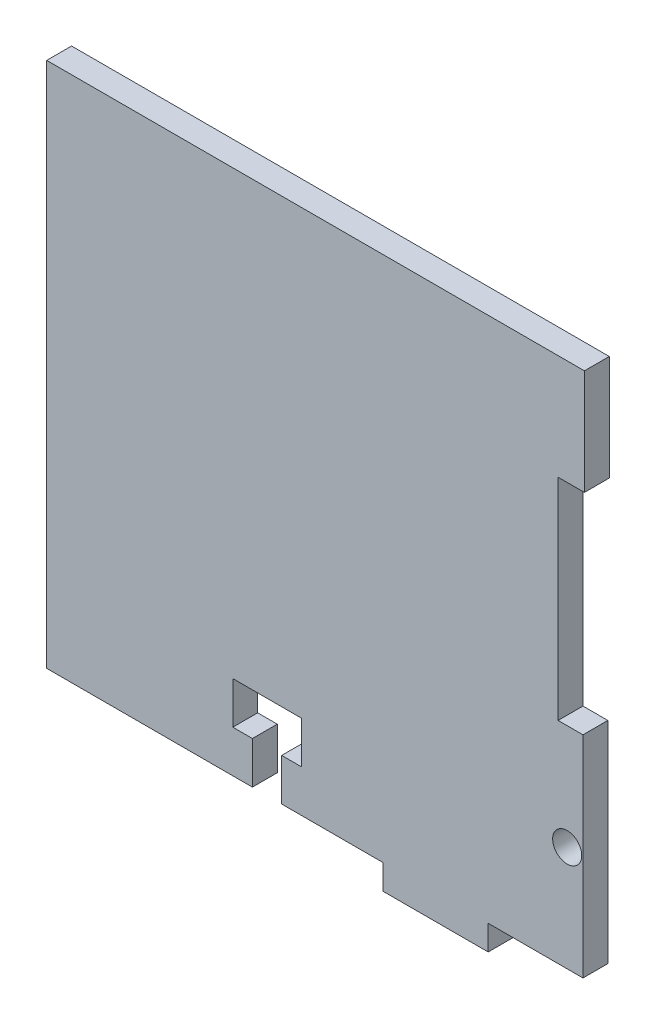
ISO-10303-21;
HEADER;
FILE_DESCRIPTION(('STEP AP214'),'2;1');
FILE_NAME('part.step','',(''),(''),'','','');
FILE_SCHEMA(('AUTOMOTIVE_DESIGN { 1 0 10303 214 1 1 1 1 }'));
ENDSEC;
DATA;
#1=APPLICATION_CONTEXT('core data for automotive mechanical design processes');
#2=APPLICATION_PROTOCOL_DEFINITION('international standard','automotive_design',2000,#1);
#3=PRODUCT_CONTEXT('',#1,'mechanical');
#4=PRODUCT('Part','Part','',(#3));
#5=PRODUCT_RELATED_PRODUCT_CATEGORY('part','',(#4));
#6=PRODUCT_DEFINITION_FORMATION('','',#4);
#7=PRODUCT_DEFINITION_CONTEXT('part definition',#1,'design');
#8=PRODUCT_DEFINITION('design','',#6,#7);
#9=PRODUCT_DEFINITION_SHAPE('','',#8);
#10=(LENGTH_UNIT() NAMED_UNIT(*) SI_UNIT(.MILLI.,.METRE.));
#11=(NAMED_UNIT(*) PLANE_ANGLE_UNIT() SI_UNIT($,.RADIAN.));
#12=(NAMED_UNIT(*) SI_UNIT($,.STERADIAN.) SOLID_ANGLE_UNIT());
#13=UNCERTAINTY_MEASURE_WITH_UNIT(LENGTH_MEASURE(1.E-05),#10,'distance_accuracy_value','');
#14=(GEOMETRIC_REPRESENTATION_CONTEXT(3) GLOBAL_UNCERTAINTY_ASSIGNED_CONTEXT((#13)) GLOBAL_UNIT_ASSIGNED_CONTEXT((#10,
#11,#12)) REPRESENTATION_CONTEXT('',''));
#15=CARTESIAN_POINT('',(0.,0.,0.));
#16=DIRECTION('',(0.,0.,1.));
#17=DIRECTION('',(1.,0.,0.));
#18=AXIS2_PLACEMENT_3D('',#15,#16,#17);
#19=CARTESIAN_POINT('',(0.,0.,3.));
#20=DIRECTION('',(0.,0.,1.));
#21=DIRECTION('',(1.,0.,0.));
#22=AXIS2_PLACEMENT_3D('',#19,#20,#21);
#23=PLANE('',#22);
#24=DIRECTION('',(1.,0.,0.));
#25=VECTOR('',#24,1.);
#26=CARTESIAN_POINT('',(102.87,-31.75,3.));
#27=LINE('',#26,#25);
#28=CARTESIAN_POINT('',(102.87,-31.75,3.));
#29=VERTEX_POINT('',#28);
#30=CARTESIAN_POINT('',(114.3,-31.75,3.));
#31=VERTEX_POINT('',#30);
#32=EDGE_CURVE('E128',#29,#31,#27,.T.);
#33=ORIENTED_EDGE('',*,*,#32,.T.);
#34=DIRECTION('',(0.,1.,0.));
#35=VECTOR('',#34,1.);
#36=CARTESIAN_POINT('',(114.3,-31.75,3.));
#37=LINE('',#36,#35);
#38=CARTESIAN_POINT('',(114.3,-6.35000000000001,3.));
#39=VERTEX_POINT('',#38);
#40=EDGE_CURVE('E350',#31,#39,#37,.T.);
#41=ORIENTED_EDGE('',*,*,#40,.T.);
#42=DIRECTION('',(-1.,0.,0.));
#43=VECTOR('',#42,1.);
#44=CARTESIAN_POINT('',(114.3,-6.35000000000001,3.));
#45=LINE('',#44,#43);
#46=CARTESIAN_POINT('',(111.3,-6.35000000000001,3.));
#47=VERTEX_POINT('',#46);
#48=EDGE_CURVE('E294',#39,#47,#45,.T.);
#49=ORIENTED_EDGE('',*,*,#48,.T.);
#50=DIRECTION('',(0.,1.,0.));
#51=VECTOR('',#50,1.);
#52=CARTESIAN_POINT('',(111.3,19.05,3.));
#53=LINE('',#52,#51);
#54=CARTESIAN_POINT('',(111.3,19.05,3.));
#55=VERTEX_POINT('',#54);
#56=EDGE_CURVE('E313',#47,#55,#53,.T.);
#57=ORIENTED_EDGE('',*,*,#56,.T.);
#58=DIRECTION('',(1.,0.,0.));
#59=VECTOR('',#58,1.);
#60=CARTESIAN_POINT('',(114.475,19.05,3.));
#61=LINE('',#60,#59);
#62=CARTESIAN_POINT('',(114.475,19.05,3.));
#63=VERTEX_POINT('',#62);
#64=EDGE_CURVE('E310',#55,#63,#61,.T.);
#65=ORIENTED_EDGE('',*,*,#64,.T.);
#66=DIRECTION('',(0.,1.,0.));
#67=VECTOR('',#66,1.);
#68=CARTESIAN_POINT('',(114.475,31.75,3.));
#69=LINE('',#68,#67);
#70=CARTESIAN_POINT('',(114.475,31.75,3.));
#71=VERTEX_POINT('',#70);
#72=EDGE_CURVE('E312',#63,#71,#69,.T.);
#73=ORIENTED_EDGE('',*,*,#72,.T.);
#74=DIRECTION('',(-1.,0.,0.));
#75=VECTOR('',#74,1.);
#76=CARTESIAN_POINT('',(111.125,31.75,3.));
#77=LINE('',#76,#75);
#78=CARTESIAN_POINT('',(49.6283285889026,31.75,3.));
#79=VERTEX_POINT('',#78);
#80=EDGE_CURVE('E315',#71,#79,#77,.T.);
#81=ORIENTED_EDGE('',*,*,#80,.T.);
#82=DIRECTION('',(0.,-1.,0.));
#83=VECTOR('',#82,1.);
#84=CARTESIAN_POINT('',(49.6283285889026,31.75,3.));
#85=LINE('',#84,#83);
#86=CARTESIAN_POINT('',(49.6283285889026,-31.75,3.));
#87=VERTEX_POINT('',#86);
#88=EDGE_CURVE('E321',#79,#87,#85,.T.);
#89=ORIENTED_EDGE('',*,*,#88,.T.);
#90=DIRECTION('',(1.,0.,0.));
#91=VECTOR('',#90,1.);
#92=CARTESIAN_POINT('',(49.6283285889026,-31.75,3.));
#93=LINE('',#92,#91);
#94=CARTESIAN_POINT('',(74.4347,-31.75,3.));
#95=VERTEX_POINT('',#94);
#96=EDGE_CURVE('E323',#87,#95,#93,.T.);
#97=ORIENTED_EDGE('',*,*,#96,.T.);
#98=DIRECTION('',(0.,1.,0.));
#99=VECTOR('',#98,1.);
#100=CARTESIAN_POINT('',(74.4347,-31.75,3.));
#101=LINE('',#100,#99);
#102=CARTESIAN_POINT('',(74.4347,-26.67,3.));
#103=VERTEX_POINT('',#102);
#104=EDGE_CURVE('E325',#95,#103,#101,.T.);
#105=ORIENTED_EDGE('',*,*,#104,.T.);
#106=DIRECTION('',(-1.,0.,0.));
#107=VECTOR('',#106,1.);
#108=CARTESIAN_POINT('',(72.0725,-26.67,3.));
#109=LINE('',#108,#107);
#110=CARTESIAN_POINT('',(72.0725,-26.67,3.));
#111=VERTEX_POINT('',#110);
#112=EDGE_CURVE('E327',#103,#111,#109,.T.);
#113=ORIENTED_EDGE('',*,*,#112,.T.);
#114=DIRECTION('',(0.,1.,0.));
#115=VECTOR('',#114,1.);
#116=CARTESIAN_POINT('',(72.0725,-26.67,3.));
#117=LINE('',#116,#115);
#118=CARTESIAN_POINT('',(72.0725,-21.59,3.));
#119=VERTEX_POINT('',#118);
#120=EDGE_CURVE('E329',#111,#119,#117,.T.);
#121=ORIENTED_EDGE('',*,*,#120,.T.);
#122=DIRECTION('',(1.,0.,0.));
#123=VECTOR('',#122,1.);
#124=CARTESIAN_POINT('',(72.0725,-21.59,3.));
#125=LINE('',#124,#123);
#126=CARTESIAN_POINT('',(80.3275,-21.59,3.));
#127=VERTEX_POINT('',#126);
#128=EDGE_CURVE('E331',#119,#127,#125,.T.);
#129=ORIENTED_EDGE('',*,*,#128,.T.);
#130=DIRECTION('',(0.,-1.,0.));
#131=VECTOR('',#130,1.);
#132=CARTESIAN_POINT('',(80.3275,-26.67,3.));
#133=LINE('',#132,#131);
#134=CARTESIAN_POINT('',(80.3275,-26.67,3.));
#135=VERTEX_POINT('',#134);
#136=EDGE_CURVE('E333',#127,#135,#133,.T.);
#137=ORIENTED_EDGE('',*,*,#136,.T.);
#138=DIRECTION('',(-1.,0.,0.));
#139=VECTOR('',#138,1.);
#140=CARTESIAN_POINT('',(77.9653,-26.67,3.));
#141=LINE('',#140,#139);
#142=CARTESIAN_POINT('',(77.9653,-26.67,3.));
#143=VERTEX_POINT('',#142);
#144=EDGE_CURVE('E335',#135,#143,#141,.T.);
#145=ORIENTED_EDGE('',*,*,#144,.T.);
#146=DIRECTION('',(0.,-1.,0.));
#147=VECTOR('',#146,1.);
#148=CARTESIAN_POINT('',(77.9653,-31.75,3.));
#149=LINE('',#148,#147);
#150=CARTESIAN_POINT('',(77.9653,-31.75,3.));
#151=VERTEX_POINT('',#150);
#152=EDGE_CURVE('E337',#143,#151,#149,.T.);
#153=ORIENTED_EDGE('',*,*,#152,.T.);
#154=DIRECTION('',(1.,0.,0.));
#155=VECTOR('',#154,1.);
#156=CARTESIAN_POINT('',(77.9653,-31.75,3.));
#157=LINE('',#156,#155);
#158=CARTESIAN_POINT('',(90.17,-31.75,3.));
#159=VERTEX_POINT('',#158);
#160=EDGE_CURVE('E184',#151,#159,#157,.T.);
#161=ORIENTED_EDGE('',*,*,#160,.T.);
#162=DIRECTION('',(0.,-1.,0.));
#163=VECTOR('',#162,1.);
#164=CARTESIAN_POINT('',(90.17,-31.75,3.));
#165=LINE('',#164,#163);
#166=CARTESIAN_POINT('',(90.17,-34.75,3.));
#167=VERTEX_POINT('',#166);
#168=EDGE_CURVE('E178',#159,#167,#165,.T.);
#169=ORIENTED_EDGE('',*,*,#168,.T.);
#170=DIRECTION('',(1.,0.,0.));
#171=VECTOR('',#170,1.);
#172=CARTESIAN_POINT('',(90.17,-34.75,3.));
#173=LINE('',#172,#171);
#174=CARTESIAN_POINT('',(102.87,-34.75,3.));
#175=VERTEX_POINT('',#174);
#176=EDGE_CURVE('E182',#167,#175,#173,.T.);
#177=ORIENTED_EDGE('',*,*,#176,.T.);
#178=DIRECTION('',(0.,1.,0.));
#179=VECTOR('',#178,1.);
#180=CARTESIAN_POINT('',(102.87,-31.75,3.));
#181=LINE('',#180,#179);
#182=EDGE_CURVE('E50',#175,#29,#181,.T.);
#183=ORIENTED_EDGE('',*,*,#182,.T.);
#184=EDGE_LOOP('',(#33,#41,#49,#57,#65,#73,#81,#89,#97,#105,#113,#121,#129,#137,#145,#153,#161,
#169,#177,#183));
#185=FACE_BOUND('',#184,.T.);
#186=CARTESIAN_POINT('',(112.395,-19.05,3.));
#187=DIRECTION('',(0.,0.,1.));
#188=DIRECTION('',(1.,0.,0.));
#189=AXIS2_PLACEMENT_3D('',#186,#187,#188);
#190=CIRCLE('',#189,1.75259999999999);
#191=CARTESIAN_POINT('',(114.1476,-19.05,3.));
#192=VERTEX_POINT('',#191);
#193=EDGE_CURVE('E204',#192,#192,#190,.T.);
#194=ORIENTED_EDGE('',*,*,#193,.F.);
#195=EDGE_LOOP('',(#194));
#196=FACE_BOUND('',#195,.T.);
#197=ADVANCED_FACE('F33',(#185,#196),#23,.T.);
#198=CARTESIAN_POINT('',(0.,0.,0.));
#199=DIRECTION('',(0.,0.,1.));
#200=DIRECTION('',(1.,0.,0.));
#201=AXIS2_PLACEMENT_3D('',#198,#199,#200);
#202=PLANE('',#201);
#203=DIRECTION('',(1.,0.,0.));
#204=VECTOR('',#203,1.);
#205=CARTESIAN_POINT('',(111.125,-31.75,0.));
#206=LINE('',#205,#204);
#207=CARTESIAN_POINT('',(102.87,-31.75,0.));
#208=VERTEX_POINT('',#207);
#209=CARTESIAN_POINT('',(114.3,-31.75,0.));
#210=VERTEX_POINT('',#209);
#211=EDGE_CURVE('E122',#208,#210,#206,.T.);
#212=ORIENTED_EDGE('',*,*,#211,.F.);
#213=DIRECTION('',(0.,1.,0.));
#214=VECTOR('',#213,1.);
#215=CARTESIAN_POINT('',(102.87,-31.75,0.));
#216=LINE('',#215,#214);
#217=CARTESIAN_POINT('',(102.87,-34.75,0.));
#218=VERTEX_POINT('',#217);
#219=EDGE_CURVE('E240',#218,#208,#216,.T.);
#220=ORIENTED_EDGE('',*,*,#219,.F.);
#221=DIRECTION('',(1.,0.,0.));
#222=VECTOR('',#221,1.);
#223=CARTESIAN_POINT('',(90.17,-34.75,0.));
#224=LINE('',#223,#222);
#225=CARTESIAN_POINT('',(90.17,-34.75,0.));
#226=VERTEX_POINT('',#225);
#227=EDGE_CURVE('E115',#226,#218,#224,.T.);
#228=ORIENTED_EDGE('',*,*,#227,.F.);
#229=DIRECTION('',(0.,-1.,0.));
#230=VECTOR('',#229,1.);
#231=CARTESIAN_POINT('',(90.17,-31.75,0.));
#232=LINE('',#231,#230);
#233=CARTESIAN_POINT('',(90.17,-31.75,0.));
#234=VERTEX_POINT('',#233);
#235=EDGE_CURVE('E192',#234,#226,#232,.T.);
#236=ORIENTED_EDGE('',*,*,#235,.F.);
#237=DIRECTION('',(1.,0.,0.));
#238=VECTOR('',#237,1.);
#239=CARTESIAN_POINT('',(88.19515,-31.75,0.));
#240=LINE('',#239,#238);
#241=CARTESIAN_POINT('',(77.9653,-31.75,0.));
#242=VERTEX_POINT('',#241);
#243=EDGE_CURVE('E236',#242,#234,#240,.T.);
#244=ORIENTED_EDGE('',*,*,#243,.F.);
#245=DIRECTION('',(0.,-1.,0.));
#246=VECTOR('',#245,1.);
#247=CARTESIAN_POINT('',(77.9653,-31.75,0.));
#248=LINE('',#247,#246);
#249=CARTESIAN_POINT('',(77.9653,-26.67,0.));
#250=VERTEX_POINT('',#249);
#251=EDGE_CURVE('E233',#250,#242,#248,.T.);
#252=ORIENTED_EDGE('',*,*,#251,.F.);
#253=DIRECTION('',(-1.,0.,0.));
#254=VECTOR('',#253,1.);
#255=CARTESIAN_POINT('',(77.9653,-26.67,0.));
#256=LINE('',#255,#254);
#257=CARTESIAN_POINT('',(80.3275,-26.67,0.));
#258=VERTEX_POINT('',#257);
#259=EDGE_CURVE('E231',#258,#250,#256,.T.);
#260=ORIENTED_EDGE('',*,*,#259,.F.);
#261=DIRECTION('',(0.,-1.,0.));
#262=VECTOR('',#261,1.);
#263=CARTESIAN_POINT('',(80.3275,-26.67,0.));
#264=LINE('',#263,#262);
#265=CARTESIAN_POINT('',(80.3275,-21.59,0.));
#266=VERTEX_POINT('',#265);
#267=EDGE_CURVE('E229',#266,#258,#264,.T.);
#268=ORIENTED_EDGE('',*,*,#267,.F.);
#269=DIRECTION('',(1.,0.,0.));
#270=VECTOR('',#269,1.);
#271=CARTESIAN_POINT('',(72.0725,-21.59,0.));
#272=LINE('',#271,#270);
#273=CARTESIAN_POINT('',(72.0725,-21.59,0.));
#274=VERTEX_POINT('',#273);
#275=EDGE_CURVE('E227',#274,#266,#272,.T.);
#276=ORIENTED_EDGE('',*,*,#275,.F.);
#277=DIRECTION('',(0.,1.,0.));
#278=VECTOR('',#277,1.);
#279=CARTESIAN_POINT('',(72.0725,-26.67,0.));
#280=LINE('',#279,#278);
#281=CARTESIAN_POINT('',(72.0725,-26.67,0.));
#282=VERTEX_POINT('',#281);
#283=EDGE_CURVE('E225',#282,#274,#280,.T.);
#284=ORIENTED_EDGE('',*,*,#283,.F.);
#285=DIRECTION('',(-1.,0.,0.));
#286=VECTOR('',#285,1.);
#287=CARTESIAN_POINT('',(72.0725,-26.67,0.));
#288=LINE('',#287,#286);
#289=CARTESIAN_POINT('',(74.4347,-26.67,0.));
#290=VERTEX_POINT('',#289);
#291=EDGE_CURVE('E223',#290,#282,#288,.T.);
#292=ORIENTED_EDGE('',*,*,#291,.F.);
#293=DIRECTION('',(0.,1.,0.));
#294=VECTOR('',#293,1.);
#295=CARTESIAN_POINT('',(74.4347,-31.75,0.));
#296=LINE('',#295,#294);
#297=CARTESIAN_POINT('',(74.4347,-31.75,0.));
#298=VERTEX_POINT('',#297);
#299=EDGE_CURVE('E221',#298,#290,#296,.T.);
#300=ORIENTED_EDGE('',*,*,#299,.F.);
#301=DIRECTION('',(1.,0.,0.));
#302=VECTOR('',#301,1.);
#303=CARTESIAN_POINT('',(49.6283285889026,-31.75,0.));
#304=LINE('',#303,#302);
#305=CARTESIAN_POINT('',(49.6283285889026,-31.75,0.));
#306=VERTEX_POINT('',#305);
#307=EDGE_CURVE('E219',#306,#298,#304,.T.);
#308=ORIENTED_EDGE('',*,*,#307,.F.);
#309=DIRECTION('',(0.,-1.,0.));
#310=VECTOR('',#309,1.);
#311=CARTESIAN_POINT('',(49.6283285889026,31.75,0.));
#312=LINE('',#311,#310);
#313=CARTESIAN_POINT('',(49.6283285889026,31.75,0.));
#314=VERTEX_POINT('',#313);
#315=EDGE_CURVE('E217',#314,#306,#312,.T.);
#316=ORIENTED_EDGE('',*,*,#315,.F.);
#317=DIRECTION('',(-1.,0.,0.));
#318=VECTOR('',#317,1.);
#319=CARTESIAN_POINT('',(49.6283285889026,31.75,0.));
#320=LINE('',#319,#318);
#321=CARTESIAN_POINT('',(114.475,31.75,0.));
#322=VERTEX_POINT('',#321);
#323=EDGE_CURVE('E215',#322,#314,#320,.T.);
#324=ORIENTED_EDGE('',*,*,#323,.F.);
#325=DIRECTION('',(0.,1.,0.));
#326=VECTOR('',#325,1.);
#327=CARTESIAN_POINT('',(114.475,31.75,0.));
#328=LINE('',#327,#326);
#329=CARTESIAN_POINT('',(114.475,19.05,0.));
#330=VERTEX_POINT('',#329);
#331=EDGE_CURVE('E212',#330,#322,#328,.T.);
#332=ORIENTED_EDGE('',*,*,#331,.F.);
#333=DIRECTION('',(1.,0.,0.));
#334=VECTOR('',#333,1.);
#335=CARTESIAN_POINT('',(114.475,19.05,0.));
#336=LINE('',#335,#334);
#337=CARTESIAN_POINT('',(111.3,19.05,0.));
#338=VERTEX_POINT('',#337);
#339=EDGE_CURVE('E210',#338,#330,#336,.T.);
#340=ORIENTED_EDGE('',*,*,#339,.F.);
#341=DIRECTION('',(0.,1.,0.));
#342=VECTOR('',#341,1.);
#343=CARTESIAN_POINT('',(111.3,19.05,0.));
#344=LINE('',#343,#342);
#345=CARTESIAN_POINT('',(111.3,-6.35000000000001,0.));
#346=VERTEX_POINT('',#345);
#347=EDGE_CURVE('E208',#346,#338,#344,.T.);
#348=ORIENTED_EDGE('',*,*,#347,.F.);
#349=DIRECTION('',(-1.,0.,0.));
#350=VECTOR('',#349,1.);
#351=CARTESIAN_POINT('',(114.3,-6.35000000000001,0.));
#352=LINE('',#351,#350);
#353=CARTESIAN_POINT('',(114.3,-6.35000000000001,0.));
#354=VERTEX_POINT('',#353);
#355=EDGE_CURVE('E206',#354,#346,#352,.T.);
#356=ORIENTED_EDGE('',*,*,#355,.F.);
#357=DIRECTION('',(0.,1.,0.));
#358=VECTOR('',#357,1.);
#359=CARTESIAN_POINT('',(114.3,-18.2294050843165,0.));
#360=LINE('',#359,#358);
#361=EDGE_CURVE('E203',#210,#354,#360,.T.);
#362=ORIENTED_EDGE('',*,*,#361,.F.);
#363=EDGE_LOOP('',(#212,#220,#228,#236,#244,#252,#260,#268,#276,#284,#292,#300,#308,#316,#324,
#332,#340,#348,#356,#362));
#364=FACE_BOUND('',#363,.T.);
#365=CARTESIAN_POINT('',(112.395,-19.05,0.));
#366=DIRECTION('',(0.,0.,1.));
#367=DIRECTION('',(1.,0.,0.));
#368=AXIS2_PLACEMENT_3D('',#365,#366,#367);
#369=CIRCLE('',#368,1.75259999999999);
#370=CARTESIAN_POINT('',(114.1476,-19.05,0.));
#371=VERTEX_POINT('',#370);
#372=EDGE_CURVE('E354',#371,#371,#369,.T.);
#373=ORIENTED_EDGE('',*,*,#372,.T.);
#374=EDGE_LOOP('',(#373));
#375=FACE_BOUND('',#374,.T.);
#376=ADVANCED_FACE('F298',(#364,#375),#202,.F.);
#377=CARTESIAN_POINT('',(111.125,-31.75,3.));
#378=DIRECTION('',(0.,1.,0.));
#379=DIRECTION('',(0.,0.,1.));
#380=AXIS2_PLACEMENT_3D('',#377,#378,#379);
#381=PLANE('',#380);
#382=ORIENTED_EDGE('',*,*,#211,.T.);
#383=DIRECTION('',(0.,0.,-1.));
#384=VECTOR('',#383,1.);
#385=CARTESIAN_POINT('',(114.3,-31.75,3.));
#386=LINE('',#385,#384);
#387=EDGE_CURVE('E11',#31,#210,#386,.T.);
#388=ORIENTED_EDGE('',*,*,#387,.F.);
#389=ORIENTED_EDGE('',*,*,#32,.F.);
#390=DIRECTION('',(0.,0.,-1.));
#391=VECTOR('',#390,1.);
#392=CARTESIAN_POINT('',(102.87,-31.75,3.));
#393=LINE('',#392,#391);
#394=EDGE_CURVE('E198',#29,#208,#393,.T.);
#395=ORIENTED_EDGE('',*,*,#394,.T.);
#396=EDGE_LOOP('',(#382,#388,#389,#395));
#397=FACE_BOUND('',#396,.T.);
#398=ADVANCED_FACE('F35',(#397),#381,.F.);
#399=CARTESIAN_POINT('',(114.3,-18.2294050843165,3.));
#400=DIRECTION('',(-1.,0.,0.));
#401=DIRECTION('',(0.,0.,1.));
#402=AXIS2_PLACEMENT_3D('',#399,#400,#401);
#403=PLANE('',#402);
#404=ORIENTED_EDGE('',*,*,#361,.T.);
#405=DIRECTION('',(0.,0.,-1.));
#406=VECTOR('',#405,1.);
#407=CARTESIAN_POINT('',(114.3,-6.35000000000001,3.));
#408=LINE('',#407,#406);
#409=EDGE_CURVE('E42',#39,#354,#408,.T.);
#410=ORIENTED_EDGE('',*,*,#409,.F.);
#411=ORIENTED_EDGE('',*,*,#40,.F.);
#412=ORIENTED_EDGE('',*,*,#387,.T.);
#413=EDGE_LOOP('',(#404,#410,#411,#412));
#414=FACE_BOUND('',#413,.T.);
#415=ADVANCED_FACE('F356',(#414),#403,.F.);
#416=CARTESIAN_POINT('',(114.3,-6.35000000000001,3.));
#417=DIRECTION('',(0.,-1.,0.));
#418=DIRECTION('',(0.,0.,-1.));
#419=AXIS2_PLACEMENT_3D('',#416,#417,#418);
#420=PLANE('',#419);
#421=ORIENTED_EDGE('',*,*,#355,.T.);
#422=DIRECTION('',(0.,0.,-1.));
#423=VECTOR('',#422,1.);
#424=CARTESIAN_POINT('',(111.3,-6.35000000000001,3.));
#425=LINE('',#424,#423);
#426=EDGE_CURVE('E285',#47,#346,#425,.T.);
#427=ORIENTED_EDGE('',*,*,#426,.F.);
#428=ORIENTED_EDGE('',*,*,#48,.F.);
#429=ORIENTED_EDGE('',*,*,#409,.T.);
#430=EDGE_LOOP('',(#421,#427,#428,#429));
#431=FACE_BOUND('',#430,.T.);
#432=ADVANCED_FACE('F292',(#431),#420,.F.);
#433=CARTESIAN_POINT('',(111.3,19.05,3.));
#434=DIRECTION('',(-1.,0.,0.));
#435=DIRECTION('',(0.,0.,1.));
#436=AXIS2_PLACEMENT_3D('',#433,#434,#435);
#437=PLANE('',#436);
#438=ORIENTED_EDGE('',*,*,#347,.T.);
#439=DIRECTION('',(0.,0.,-1.));
#440=VECTOR('',#439,1.);
#441=CARTESIAN_POINT('',(111.3,19.05,3.));
#442=LINE('',#441,#440);
#443=EDGE_CURVE('E282',#55,#338,#442,.T.);
#444=ORIENTED_EDGE('',*,*,#443,.F.);
#445=ORIENTED_EDGE('',*,*,#56,.F.);
#446=ORIENTED_EDGE('',*,*,#426,.T.);
#447=EDGE_LOOP('',(#438,#444,#445,#446));
#448=FACE_BOUND('',#447,.T.);
#449=ADVANCED_FACE('F304',(#448),#437,.F.);
#450=CARTESIAN_POINT('',(114.475,19.05,3.));
#451=DIRECTION('',(0.,1.,0.));
#452=DIRECTION('',(0.,0.,1.));
#453=AXIS2_PLACEMENT_3D('',#450,#451,#452);
#454=PLANE('',#453);
#455=ORIENTED_EDGE('',*,*,#339,.T.);
#456=DIRECTION('',(0.,0.,-1.));
#457=VECTOR('',#456,1.);
#458=CARTESIAN_POINT('',(114.475,19.05,3.));
#459=LINE('',#458,#457);
#460=EDGE_CURVE('E279',#63,#330,#459,.T.);
#461=ORIENTED_EDGE('',*,*,#460,.F.);
#462=ORIENTED_EDGE('',*,*,#64,.F.);
#463=ORIENTED_EDGE('',*,*,#443,.T.);
#464=EDGE_LOOP('',(#455,#461,#462,#463));
#465=FACE_BOUND('',#464,.T.);
#466=ADVANCED_FACE('F308',(#465),#454,.F.);
#467=CARTESIAN_POINT('',(114.475,31.75,3.));
#468=DIRECTION('',(-1.,0.,0.));
#469=DIRECTION('',(0.,0.,1.));
#470=AXIS2_PLACEMENT_3D('',#467,#468,#469);
#471=PLANE('',#470);
#472=ORIENTED_EDGE('',*,*,#331,.T.);
#473=DIRECTION('',(0.,0.,-1.));
#474=VECTOR('',#473,1.);
#475=CARTESIAN_POINT('',(114.475,31.75,3.));
#476=LINE('',#475,#474);
#477=EDGE_CURVE('E276',#71,#322,#476,.T.);
#478=ORIENTED_EDGE('',*,*,#477,.F.);
#479=ORIENTED_EDGE('',*,*,#72,.F.);
#480=ORIENTED_EDGE('',*,*,#460,.T.);
#481=EDGE_LOOP('',(#472,#478,#479,#480));
#482=FACE_BOUND('',#481,.T.);
#483=ADVANCED_FACE('F417',(#482),#471,.F.);
#484=CARTESIAN_POINT('',(49.6283285889026,31.75,3.));
#485=DIRECTION('',(0.,-1.,0.));
#486=DIRECTION('',(0.,0.,-1.));
#487=AXIS2_PLACEMENT_3D('',#484,#485,#486);
#488=PLANE('',#487);
#489=ORIENTED_EDGE('',*,*,#323,.T.);
#490=DIRECTION('',(0.,0.,-1.));
#491=VECTOR('',#490,1.);
#492=CARTESIAN_POINT('',(49.6283285889026,31.75,3.));
#493=LINE('',#492,#491);
#494=EDGE_CURVE('E273',#79,#314,#493,.T.);
#495=ORIENTED_EDGE('',*,*,#494,.F.);
#496=ORIENTED_EDGE('',*,*,#80,.F.);
#497=ORIENTED_EDGE('',*,*,#477,.T.);
#498=EDGE_LOOP('',(#489,#495,#496,#497));
#499=FACE_BOUND('',#498,.T.);
#500=ADVANCED_FACE('F413',(#499),#488,.F.);
#501=CARTESIAN_POINT('',(49.6283285889026,31.75,3.));
#502=DIRECTION('',(1.,0.,0.));
#503=DIRECTION('',(0.,0.,-1.));
#504=AXIS2_PLACEMENT_3D('',#501,#502,#503);
#505=PLANE('',#504);
#506=ORIENTED_EDGE('',*,*,#315,.T.);
#507=DIRECTION('',(0.,0.,-1.));
#508=VECTOR('',#507,1.);
#509=CARTESIAN_POINT('',(49.6283285889026,-31.75,3.));
#510=LINE('',#509,#508);
#511=EDGE_CURVE('E270',#87,#306,#510,.T.);
#512=ORIENTED_EDGE('',*,*,#511,.F.);
#513=ORIENTED_EDGE('',*,*,#88,.F.);
#514=ORIENTED_EDGE('',*,*,#494,.T.);
#515=EDGE_LOOP('',(#506,#512,#513,#514));
#516=FACE_BOUND('',#515,.T.);
#517=ADVANCED_FACE('F409',(#516),#505,.F.);
#518=CARTESIAN_POINT('',(49.6283285889026,-31.75,3.));
#519=DIRECTION('',(0.,1.,0.));
#520=DIRECTION('',(0.,0.,1.));
#521=AXIS2_PLACEMENT_3D('',#518,#519,#520);
#522=PLANE('',#521);
#523=ORIENTED_EDGE('',*,*,#307,.T.);
#524=DIRECTION('',(0.,0.,-1.));
#525=VECTOR('',#524,1.);
#526=CARTESIAN_POINT('',(74.4347,-31.75,3.));
#527=LINE('',#526,#525);
#528=EDGE_CURVE('E267',#95,#298,#527,.T.);
#529=ORIENTED_EDGE('',*,*,#528,.F.);
#530=ORIENTED_EDGE('',*,*,#96,.F.);
#531=ORIENTED_EDGE('',*,*,#511,.T.);
#532=EDGE_LOOP('',(#523,#529,#530,#531));
#533=FACE_BOUND('',#532,.T.);
#534=ADVANCED_FACE('F405',(#533),#522,.F.);
#535=CARTESIAN_POINT('',(74.4347,-31.75,3.));
#536=DIRECTION('',(-1.,0.,0.));
#537=DIRECTION('',(0.,-1.,0.));
#538=AXIS2_PLACEMENT_3D('',#535,#536,#537);
#539=PLANE('',#538);
#540=ORIENTED_EDGE('',*,*,#299,.T.);
#541=DIRECTION('',(0.,0.,-1.));
#542=VECTOR('',#541,1.);
#543=CARTESIAN_POINT('',(74.4347,-26.67,3.));
#544=LINE('',#543,#542);
#545=EDGE_CURVE('E264',#103,#290,#544,.T.);
#546=ORIENTED_EDGE('',*,*,#545,.F.);
#547=ORIENTED_EDGE('',*,*,#104,.F.);
#548=ORIENTED_EDGE('',*,*,#528,.T.);
#549=EDGE_LOOP('',(#540,#546,#547,#548));
#550=FACE_BOUND('',#549,.T.);
#551=ADVANCED_FACE('F401',(#550),#539,.F.);
#552=CARTESIAN_POINT('',(72.0725,-26.67,3.));
#553=DIRECTION('',(0.,-1.,0.));
#554=DIRECTION('',(0.,0.,-1.));
#555=AXIS2_PLACEMENT_3D('',#552,#553,#554);
#556=PLANE('',#555);
#557=ORIENTED_EDGE('',*,*,#291,.T.);
#558=DIRECTION('',(0.,0.,-1.));
#559=VECTOR('',#558,1.);
#560=CARTESIAN_POINT('',(72.0725,-26.67,3.));
#561=LINE('',#560,#559);
#562=EDGE_CURVE('E261',#111,#282,#561,.T.);
#563=ORIENTED_EDGE('',*,*,#562,.F.);
#564=ORIENTED_EDGE('',*,*,#112,.F.);
#565=ORIENTED_EDGE('',*,*,#545,.T.);
#566=EDGE_LOOP('',(#557,#563,#564,#565));
#567=FACE_BOUND('',#566,.T.);
#568=ADVANCED_FACE('F397',(#567),#556,.F.);
#569=CARTESIAN_POINT('',(72.0725,-26.67,3.));
#570=DIRECTION('',(-1.,0.,0.));
#571=DIRECTION('',(0.,-1.,0.));
#572=AXIS2_PLACEMENT_3D('',#569,#570,#571);
#573=PLANE('',#572);
#574=ORIENTED_EDGE('',*,*,#283,.T.);
#575=DIRECTION('',(0.,0.,-1.));
#576=VECTOR('',#575,1.);
#577=CARTESIAN_POINT('',(72.0725,-21.59,3.));
#578=LINE('',#577,#576);
#579=EDGE_CURVE('E258',#119,#274,#578,.T.);
#580=ORIENTED_EDGE('',*,*,#579,.F.);
#581=ORIENTED_EDGE('',*,*,#120,.F.);
#582=ORIENTED_EDGE('',*,*,#562,.T.);
#583=EDGE_LOOP('',(#574,#580,#581,#582));
#584=FACE_BOUND('',#583,.T.);
#585=ADVANCED_FACE('F393',(#584),#573,.F.);
#586=CARTESIAN_POINT('',(72.0725,-21.59,3.));
#587=DIRECTION('',(0.,1.,0.));
#588=DIRECTION('',(0.,0.,1.));
#589=AXIS2_PLACEMENT_3D('',#586,#587,#588);
#590=PLANE('',#589);
#591=ORIENTED_EDGE('',*,*,#275,.T.);
#592=DIRECTION('',(0.,0.,-1.));
#593=VECTOR('',#592,1.);
#594=CARTESIAN_POINT('',(80.3275,-21.59,3.));
#595=LINE('',#594,#593);
#596=EDGE_CURVE('E255',#127,#266,#595,.T.);
#597=ORIENTED_EDGE('',*,*,#596,.F.);
#598=ORIENTED_EDGE('',*,*,#128,.F.);
#599=ORIENTED_EDGE('',*,*,#579,.T.);
#600=EDGE_LOOP('',(#591,#597,#598,#599));
#601=FACE_BOUND('',#600,.T.);
#602=ADVANCED_FACE('F389',(#601),#590,.F.);
#603=CARTESIAN_POINT('',(80.3275,-26.67,3.));
#604=DIRECTION('',(1.,0.,0.));
#605=DIRECTION('',(0.,0.,-1.));
#606=AXIS2_PLACEMENT_3D('',#603,#604,#605);
#607=PLANE('',#606);
#608=ORIENTED_EDGE('',*,*,#267,.T.);
#609=DIRECTION('',(0.,0.,-1.));
#610=VECTOR('',#609,1.);
#611=CARTESIAN_POINT('',(80.3275,-26.67,3.));
#612=LINE('',#611,#610);
#613=EDGE_CURVE('E252',#135,#258,#612,.T.);
#614=ORIENTED_EDGE('',*,*,#613,.F.);
#615=ORIENTED_EDGE('',*,*,#136,.F.);
#616=ORIENTED_EDGE('',*,*,#596,.T.);
#617=EDGE_LOOP('',(#608,#614,#615,#616));
#618=FACE_BOUND('',#617,.T.);
#619=ADVANCED_FACE('F385',(#618),#607,.F.);
#620=CARTESIAN_POINT('',(77.9653,-26.67,3.));
#621=DIRECTION('',(0.,-1.,0.));
#622=DIRECTION('',(0.,0.,-1.));
#623=AXIS2_PLACEMENT_3D('',#620,#621,#622);
#624=PLANE('',#623);
#625=ORIENTED_EDGE('',*,*,#259,.T.);
#626=DIRECTION('',(0.,0.,-1.));
#627=VECTOR('',#626,1.);
#628=CARTESIAN_POINT('',(77.9653,-26.67,3.));
#629=LINE('',#628,#627);
#630=EDGE_CURVE('E249',#143,#250,#629,.T.);
#631=ORIENTED_EDGE('',*,*,#630,.F.);
#632=ORIENTED_EDGE('',*,*,#144,.F.);
#633=ORIENTED_EDGE('',*,*,#613,.T.);
#634=EDGE_LOOP('',(#625,#631,#632,#633));
#635=FACE_BOUND('',#634,.T.);
#636=ADVANCED_FACE('F382',(#635),#624,.F.);
#637=CARTESIAN_POINT('',(77.9653,-31.75,3.));
#638=DIRECTION('',(1.,0.,0.));
#639=DIRECTION('',(0.,0.,-1.));
#640=AXIS2_PLACEMENT_3D('',#637,#638,#639);
#641=PLANE('',#640);
#642=ORIENTED_EDGE('',*,*,#251,.T.);
#643=DIRECTION('',(0.,0.,-1.));
#644=VECTOR('',#643,1.);
#645=CARTESIAN_POINT('',(77.9653,-31.75,3.));
#646=LINE('',#645,#644);
#647=EDGE_CURVE('E246',#151,#242,#646,.T.);
#648=ORIENTED_EDGE('',*,*,#647,.F.);
#649=ORIENTED_EDGE('',*,*,#152,.F.);
#650=ORIENTED_EDGE('',*,*,#630,.T.);
#651=EDGE_LOOP('',(#642,#648,#649,#650));
#652=FACE_BOUND('',#651,.T.);
#653=ADVANCED_FACE('F343',(#652),#641,.F.);
#654=CARTESIAN_POINT('',(88.19515,-31.75,3.));
#655=DIRECTION('',(0.,1.,0.));
#656=DIRECTION('',(-1.,0.,0.));
#657=AXIS2_PLACEMENT_3D('',#654,#655,#656);
#658=PLANE('',#657);
#659=ORIENTED_EDGE('',*,*,#243,.T.);
#660=DIRECTION('',(0.,0.,-1.));
#661=VECTOR('',#660,1.);
#662=CARTESIAN_POINT('',(90.17,-31.75,3.));
#663=LINE('',#662,#661);
#664=EDGE_CURVE('E193',#159,#234,#663,.T.);
#665=ORIENTED_EDGE('',*,*,#664,.F.);
#666=ORIENTED_EDGE('',*,*,#160,.F.);
#667=ORIENTED_EDGE('',*,*,#647,.T.);
#668=EDGE_LOOP('',(#659,#665,#666,#667));
#669=FACE_BOUND('',#668,.T.);
#670=ADVANCED_FACE('F346',(#669),#658,.F.);
#671=CARTESIAN_POINT('',(90.17,-31.75,3.));
#672=DIRECTION('',(1.,0.,0.));
#673=DIRECTION('',(0.,0.,-1.));
#674=AXIS2_PLACEMENT_3D('',#671,#672,#673);
#675=PLANE('',#674);
#676=ORIENTED_EDGE('',*,*,#235,.T.);
#677=DIRECTION('',(0.,0.,-1.));
#678=VECTOR('',#677,1.);
#679=CARTESIAN_POINT('',(90.17,-34.75,3.));
#680=LINE('',#679,#678);
#681=EDGE_CURVE('E189',#167,#226,#680,.T.);
#682=ORIENTED_EDGE('',*,*,#681,.F.);
#683=ORIENTED_EDGE('',*,*,#168,.F.);
#684=ORIENTED_EDGE('',*,*,#664,.T.);
#685=EDGE_LOOP('',(#676,#682,#683,#684));
#686=FACE_BOUND('',#685,.T.);
#687=ADVANCED_FACE('F190',(#686),#675,.F.);
#688=CARTESIAN_POINT('',(90.17,-34.75,3.));
#689=DIRECTION('',(0.,1.,0.));
#690=DIRECTION('',(0.,0.,1.));
#691=AXIS2_PLACEMENT_3D('',#688,#689,#690);
#692=PLANE('',#691);
#693=ORIENTED_EDGE('',*,*,#227,.T.);
#694=DIRECTION('',(0.,0.,-1.));
#695=VECTOR('',#694,1.);
#696=CARTESIAN_POINT('',(102.87,-34.75,3.));
#697=LINE('',#696,#695);
#698=EDGE_CURVE('E194',#175,#218,#697,.T.);
#699=ORIENTED_EDGE('',*,*,#698,.F.);
#700=ORIENTED_EDGE('',*,*,#176,.F.);
#701=ORIENTED_EDGE('',*,*,#681,.T.);
#702=EDGE_LOOP('',(#693,#699,#700,#701));
#703=FACE_BOUND('',#702,.T.);
#704=ADVANCED_FACE('F196',(#703),#692,.F.);
#705=CARTESIAN_POINT('',(102.87,-31.75,3.));
#706=DIRECTION('',(-1.,0.,0.));
#707=DIRECTION('',(0.,0.,1.));
#708=AXIS2_PLACEMENT_3D('',#705,#706,#707);
#709=PLANE('',#708);
#710=ORIENTED_EDGE('',*,*,#219,.T.);
#711=ORIENTED_EDGE('',*,*,#394,.F.);
#712=ORIENTED_EDGE('',*,*,#182,.F.);
#713=ORIENTED_EDGE('',*,*,#698,.T.);
#714=EDGE_LOOP('',(#710,#711,#712,#713));
#715=FACE_BOUND('',#714,.T.);
#716=ADVANCED_FACE('F348',(#715),#709,.F.);
#717=CARTESIAN_POINT('',(112.395,-19.05,3.));
#718=DIRECTION('',(0.,0.,-1.));
#719=DIRECTION('',(-1.,0.,0.));
#720=AXIS2_PLACEMENT_3D('',#717,#718,#719);
#721=CYLINDRICAL_SURFACE('',#720,1.75259999999999);
#722=ORIENTED_EDGE('',*,*,#193,.T.);
#723=EDGE_LOOP('',(#722));
#724=FACE_BOUND('',#723,.T.);
#725=ORIENTED_EDGE('',*,*,#372,.F.);
#726=EDGE_LOOP('',(#725));
#727=FACE_BOUND('',#726,.T.);
#728=ADVANCED_FACE('F370',(#724,#727),#721,.F.);
#729=CLOSED_SHELL('',(#197,#376,#398,#415,#432,#449,#466,#483,#500,#517,#534,#551,#568,#585,
#602,#619,#636,#653,#670,#687,#704,#716,#728));
#730=MANIFOLD_SOLID_BREP('B2',#729);
#731=ADVANCED_BREP_SHAPE_REPRESENTATION('',(#18,#730),#14);
#732=SHAPE_DEFINITION_REPRESENTATION(#9,#731);
ENDSEC;
END-ISO-10303-21;
